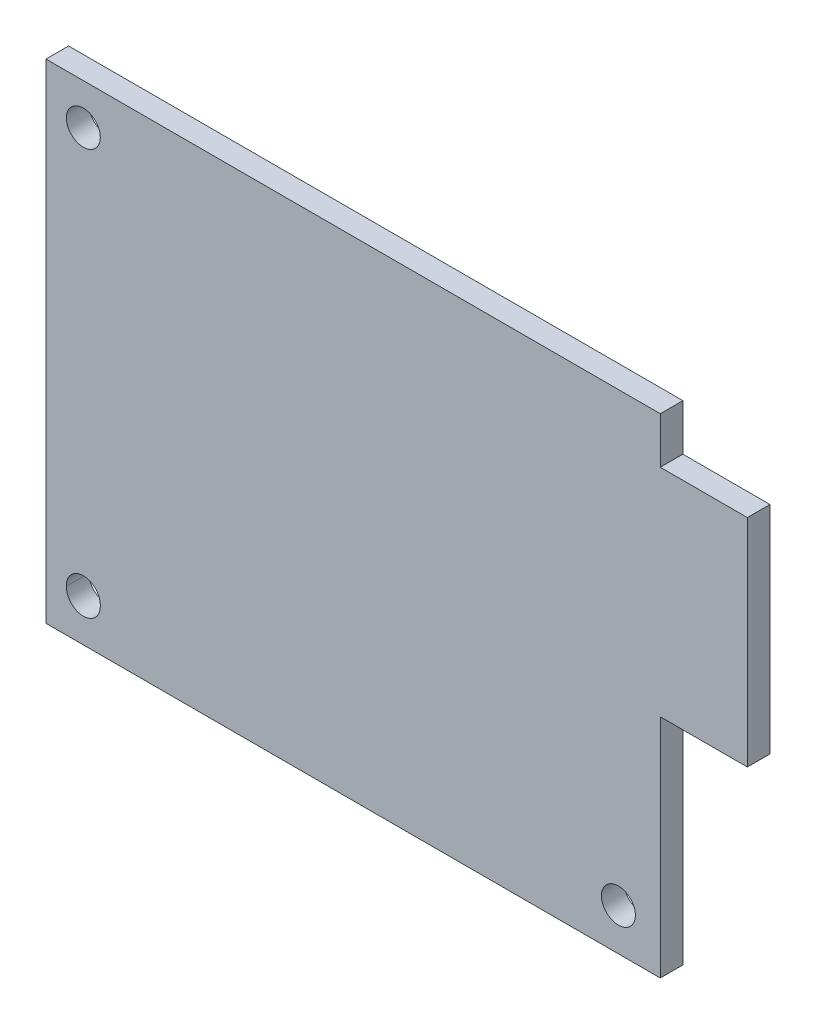
ISO-10303-21;
HEADER;
FILE_DESCRIPTION(('STEP AP214'),'2;1');
FILE_NAME('part.step','',(''),(''),'','','');
FILE_SCHEMA(('AUTOMOTIVE_DESIGN { 1 0 10303 214 1 1 1 1 }'));
ENDSEC;
DATA;
#1=APPLICATION_CONTEXT('core data for automotive mechanical design processes');
#2=APPLICATION_PROTOCOL_DEFINITION('international standard','automotive_design',2000,#1);
#3=PRODUCT_CONTEXT('',#1,'mechanical');
#4=PRODUCT('Part','Part','',(#3));
#5=PRODUCT_RELATED_PRODUCT_CATEGORY('part','',(#4));
#6=PRODUCT_DEFINITION_FORMATION('','',#4);
#7=PRODUCT_DEFINITION_CONTEXT('part definition',#1,'design');
#8=PRODUCT_DEFINITION('design','',#6,#7);
#9=PRODUCT_DEFINITION_SHAPE('','',#8);
#10=(LENGTH_UNIT() NAMED_UNIT(*) SI_UNIT(.MILLI.,.METRE.));
#11=(NAMED_UNIT(*) PLANE_ANGLE_UNIT() SI_UNIT($,.RADIAN.));
#12=(NAMED_UNIT(*) SI_UNIT($,.STERADIAN.) SOLID_ANGLE_UNIT());
#13=UNCERTAINTY_MEASURE_WITH_UNIT(LENGTH_MEASURE(1.E-05),#10,'distance_accuracy_value','');
#14=(GEOMETRIC_REPRESENTATION_CONTEXT(3) GLOBAL_UNCERTAINTY_ASSIGNED_CONTEXT((#13)) GLOBAL_UNIT_ASSIGNED_CONTEXT((#10,
#11,#12)) REPRESENTATION_CONTEXT('',''));
#15=CARTESIAN_POINT('',(0.,0.,0.));
#16=DIRECTION('',(0.,0.,1.));
#17=DIRECTION('',(1.,0.,0.));
#18=AXIS2_PLACEMENT_3D('',#15,#16,#17);
#19=CARTESIAN_POINT('',(27.15,-1.6,2.));
#20=DIRECTION('',(-1.,0.,0.));
#21=DIRECTION('',(0.,-1.,0.));
#22=AXIS2_PLACEMENT_3D('',#19,#20,#21);
#23=PLANE('',#22);
#24=DIRECTION('',(0.,1.,0.));
#25=VECTOR('',#24,1.);
#26=CARTESIAN_POINT('',(27.15,-1.6,0.));
#27=LINE('',#26,#25);
#28=CARTESIAN_POINT('',(27.15,-21.6,0.));
#29=VERTEX_POINT('',#28);
#30=CARTESIAN_POINT('',(27.15,-1.6,0.));
#31=VERTEX_POINT('',#30);
#32=EDGE_CURVE('E140',#29,#31,#27,.T.);
#33=ORIENTED_EDGE('',*,*,#32,.T.);
#34=DIRECTION('',(0.,0.,-1.));
#35=VECTOR('',#34,1.);
#36=CARTESIAN_POINT('',(27.15,-1.6,2.));
#37=LINE('',#36,#35);
#38=CARTESIAN_POINT('',(27.15,-1.6,2.));
#39=VERTEX_POINT('',#38);
#40=EDGE_CURVE('E40',#39,#31,#37,.T.);
#41=ORIENTED_EDGE('',*,*,#40,.F.);
#42=DIRECTION('',(0.,1.,0.));
#43=VECTOR('',#42,1.);
#44=CARTESIAN_POINT('',(27.15,-1.6,2.));
#45=LINE('',#44,#43);
#46=CARTESIAN_POINT('',(27.15,-21.6,2.));
#47=VERTEX_POINT('',#46);
#48=EDGE_CURVE('E156',#47,#39,#45,.T.);
#49=ORIENTED_EDGE('',*,*,#48,.F.);
#50=DIRECTION('',(0.,0.,-1.));
#51=VECTOR('',#50,1.);
#52=CARTESIAN_POINT('',(27.15,-21.6,2.));
#53=LINE('',#52,#51);
#54=EDGE_CURVE('E136',#47,#29,#53,.T.);
#55=ORIENTED_EDGE('',*,*,#54,.T.);
#56=EDGE_LOOP('',(#33,#41,#49,#55));
#57=FACE_BOUND('',#56,.T.);
#58=ADVANCED_FACE('F33',(#57),#23,.F.);
#59=CARTESIAN_POINT('',(34.85,-1.6,2.));
#60=DIRECTION('',(0.,1.,0.));
#61=DIRECTION('',(-1.,0.,0.));
#62=AXIS2_PLACEMENT_3D('',#59,#60,#61);
#63=PLANE('',#62);
#64=DIRECTION('',(1.,0.,0.));
#65=VECTOR('',#64,1.);
#66=CARTESIAN_POINT('',(34.85,-1.6,0.));
#67=LINE('',#66,#65);
#68=CARTESIAN_POINT('',(34.85,-1.6,0.));
#69=VERTEX_POINT('',#68);
#70=EDGE_CURVE('E143',#31,#69,#67,.T.);
#71=ORIENTED_EDGE('',*,*,#70,.T.);
#72=DIRECTION('',(0.,0.,-1.));
#73=VECTOR('',#72,1.);
#74=CARTESIAN_POINT('',(34.85,-1.6,2.));
#75=LINE('',#74,#73);
#76=CARTESIAN_POINT('',(34.85,-1.6,2.));
#77=VERTEX_POINT('',#76);
#78=EDGE_CURVE('E166',#77,#69,#75,.T.);
#79=ORIENTED_EDGE('',*,*,#78,.F.);
#80=DIRECTION('',(1.,0.,0.));
#81=VECTOR('',#80,1.);
#82=CARTESIAN_POINT('',(34.85,-1.6,2.));
#83=LINE('',#82,#81);
#84=EDGE_CURVE('E97',#39,#77,#83,.T.);
#85=ORIENTED_EDGE('',*,*,#84,.F.);
#86=ORIENTED_EDGE('',*,*,#40,.T.);
#87=EDGE_LOOP('',(#71,#79,#85,#86));
#88=FACE_BOUND('',#87,.T.);
#89=ADVANCED_FACE('F169',(#88),#63,.F.);
#90=CARTESIAN_POINT('',(34.85,17.5,2.));
#91=DIRECTION('',(-1.,0.,0.));
#92=DIRECTION('',(0.,-1.,0.));
#93=AXIS2_PLACEMENT_3D('',#90,#91,#92);
#94=PLANE('',#93);
#95=DIRECTION('',(0.,1.,0.));
#96=VECTOR('',#95,1.);
#97=CARTESIAN_POINT('',(34.85,17.5,0.));
#98=LINE('',#97,#96);
#99=CARTESIAN_POINT('',(34.85,17.5,0.));
#100=VERTEX_POINT('',#99);
#101=EDGE_CURVE('E146',#69,#100,#98,.T.);
#102=ORIENTED_EDGE('',*,*,#101,.T.);
#103=DIRECTION('',(0.,0.,-1.));
#104=VECTOR('',#103,1.);
#105=CARTESIAN_POINT('',(34.85,17.5,2.));
#106=LINE('',#105,#104);
#107=CARTESIAN_POINT('',(34.85,17.5,2.));
#108=VERTEX_POINT('',#107);
#109=EDGE_CURVE('E163',#108,#100,#106,.T.);
#110=ORIENTED_EDGE('',*,*,#109,.F.);
#111=DIRECTION('',(0.,1.,0.));
#112=VECTOR('',#111,1.);
#113=CARTESIAN_POINT('',(34.85,17.5,2.));
#114=LINE('',#113,#112);
#115=EDGE_CURVE('E187',#77,#108,#114,.T.);
#116=ORIENTED_EDGE('',*,*,#115,.F.);
#117=ORIENTED_EDGE('',*,*,#78,.T.);
#118=EDGE_LOOP('',(#102,#110,#116,#117));
#119=FACE_BOUND('',#118,.T.);
#120=ADVANCED_FACE('F180',(#119),#94,.F.);
#121=CARTESIAN_POINT('',(27.15,17.5,2.));
#122=DIRECTION('',(0.,-1.,0.));
#123=DIRECTION('',(0.,0.,-1.));
#124=AXIS2_PLACEMENT_3D('',#121,#122,#123);
#125=PLANE('',#124);
#126=DIRECTION('',(-1.,0.,0.));
#127=VECTOR('',#126,1.);
#128=CARTESIAN_POINT('',(27.15,17.5,0.));
#129=LINE('',#128,#127);
#130=CARTESIAN_POINT('',(27.15,17.5,0.));
#131=VERTEX_POINT('',#130);
#132=EDGE_CURVE('E148',#100,#131,#129,.T.);
#133=ORIENTED_EDGE('',*,*,#132,.T.);
#134=DIRECTION('',(0.,0.,-1.));
#135=VECTOR('',#134,1.);
#136=CARTESIAN_POINT('',(27.15,17.5,2.));
#137=LINE('',#136,#135);
#138=CARTESIAN_POINT('',(27.15,17.5,2.));
#139=VERTEX_POINT('',#138);
#140=EDGE_CURVE('E160',#139,#131,#137,.T.);
#141=ORIENTED_EDGE('',*,*,#140,.F.);
#142=DIRECTION('',(-1.,0.,0.));
#143=VECTOR('',#142,1.);
#144=CARTESIAN_POINT('',(27.15,17.5,2.));
#145=LINE('',#144,#143);
#146=EDGE_CURVE('E186',#108,#139,#145,.T.);
#147=ORIENTED_EDGE('',*,*,#146,.F.);
#148=ORIENTED_EDGE('',*,*,#109,.T.);
#149=EDGE_LOOP('',(#133,#141,#147,#148));
#150=FACE_BOUND('',#149,.T.);
#151=ADVANCED_FACE('F184',(#150),#125,.F.);
#152=CARTESIAN_POINT('',(27.15,21.6,2.));
#153=DIRECTION('',(-1.,0.,0.));
#154=DIRECTION('',(0.,0.,1.));
#155=AXIS2_PLACEMENT_3D('',#152,#153,#154);
#156=PLANE('',#155);
#157=DIRECTION('',(0.,1.,0.));
#158=VECTOR('',#157,1.);
#159=CARTESIAN_POINT('',(27.15,21.6,0.));
#160=LINE('',#159,#158);
#161=CARTESIAN_POINT('',(27.15,21.6,0.));
#162=VERTEX_POINT('',#161);
#163=EDGE_CURVE('E150',#131,#162,#160,.T.);
#164=ORIENTED_EDGE('',*,*,#163,.T.);
#165=DIRECTION('',(0.,0.,-1.));
#166=VECTOR('',#165,1.);
#167=CARTESIAN_POINT('',(27.15,21.6,2.));
#168=LINE('',#167,#166);
#169=CARTESIAN_POINT('',(27.15,21.6,2.));
#170=VERTEX_POINT('',#169);
#171=EDGE_CURVE('E131',#170,#162,#168,.T.);
#172=ORIENTED_EDGE('',*,*,#171,.F.);
#173=DIRECTION('',(0.,1.,0.));
#174=VECTOR('',#173,1.);
#175=CARTESIAN_POINT('',(27.15,21.6,2.));
#176=LINE('',#175,#174);
#177=EDGE_CURVE('E119',#139,#170,#176,.T.);
#178=ORIENTED_EDGE('',*,*,#177,.F.);
#179=ORIENTED_EDGE('',*,*,#140,.T.);
#180=EDGE_LOOP('',(#164,#172,#178,#179));
#181=FACE_BOUND('',#180,.T.);
#182=ADVANCED_FACE('F254',(#181),#156,.F.);
#183=CARTESIAN_POINT('',(-27.15,21.6,2.));
#184=DIRECTION('',(0.,-1.,0.));
#185=DIRECTION('',(0.,0.,-1.));
#186=AXIS2_PLACEMENT_3D('',#183,#184,#185);
#187=PLANE('',#186);
#188=DIRECTION('',(-1.,0.,0.));
#189=VECTOR('',#188,1.);
#190=CARTESIAN_POINT('',(-27.15,21.6,0.));
#191=LINE('',#190,#189);
#192=CARTESIAN_POINT('',(-27.15,21.6,0.));
#193=VERTEX_POINT('',#192);
#194=EDGE_CURVE('E128',#162,#193,#191,.T.);
#195=ORIENTED_EDGE('',*,*,#194,.T.);
#196=DIRECTION('',(0.,0.,-1.));
#197=VECTOR('',#196,1.);
#198=CARTESIAN_POINT('',(-27.15,21.6,2.));
#199=LINE('',#198,#197);
#200=CARTESIAN_POINT('',(-27.15,21.6,2.));
#201=VERTEX_POINT('',#200);
#202=EDGE_CURVE('E125',#201,#193,#199,.T.);
#203=ORIENTED_EDGE('',*,*,#202,.F.);
#204=DIRECTION('',(-1.,0.,0.));
#205=VECTOR('',#204,1.);
#206=CARTESIAN_POINT('',(-27.15,21.6,2.));
#207=LINE('',#206,#205);
#208=EDGE_CURVE('E112',#170,#201,#207,.T.);
#209=ORIENTED_EDGE('',*,*,#208,.F.);
#210=ORIENTED_EDGE('',*,*,#171,.T.);
#211=EDGE_LOOP('',(#195,#203,#209,#210));
#212=FACE_BOUND('',#211,.T.);
#213=ADVANCED_FACE('F126',(#212),#187,.F.);
#214=CARTESIAN_POINT('',(-27.15,21.6,2.));
#215=DIRECTION('',(1.,0.,0.));
#216=DIRECTION('',(0.,1.,0.));
#217=AXIS2_PLACEMENT_3D('',#214,#215,#216);
#218=PLANE('',#217);
#219=DIRECTION('',(0.,-1.,0.));
#220=VECTOR('',#219,1.);
#221=CARTESIAN_POINT('',(-27.15,21.6,0.));
#222=LINE('',#221,#220);
#223=CARTESIAN_POINT('',(-27.15,-21.6,0.));
#224=VERTEX_POINT('',#223);
#225=EDGE_CURVE('E153',#193,#224,#222,.T.);
#226=ORIENTED_EDGE('',*,*,#225,.T.);
#227=DIRECTION('',(0.,0.,-1.));
#228=VECTOR('',#227,1.);
#229=CARTESIAN_POINT('',(-27.15,-21.6,2.));
#230=LINE('',#229,#228);
#231=CARTESIAN_POINT('',(-27.15,-21.6,2.));
#232=VERTEX_POINT('',#231);
#233=EDGE_CURVE('E132',#232,#224,#230,.T.);
#234=ORIENTED_EDGE('',*,*,#233,.F.);
#235=DIRECTION('',(0.,-1.,0.));
#236=VECTOR('',#235,1.);
#237=CARTESIAN_POINT('',(-27.15,21.6,2.));
#238=LINE('',#237,#236);
#239=EDGE_CURVE('E116',#201,#232,#238,.T.);
#240=ORIENTED_EDGE('',*,*,#239,.F.);
#241=ORIENTED_EDGE('',*,*,#202,.T.);
#242=EDGE_LOOP('',(#226,#234,#240,#241));
#243=FACE_BOUND('',#242,.T.);
#244=ADVANCED_FACE('F134',(#243),#218,.F.);
#245=CARTESIAN_POINT('',(-27.15,-21.6,2.));
#246=DIRECTION('',(0.,1.,0.));
#247=DIRECTION('',(0.,0.,1.));
#248=AXIS2_PLACEMENT_3D('',#245,#246,#247);
#249=PLANE('',#248);
#250=DIRECTION('',(1.,0.,0.));
#251=VECTOR('',#250,1.);
#252=CARTESIAN_POINT('',(-27.15,-21.6,0.));
#253=LINE('',#252,#251);
#254=EDGE_CURVE('E88',#224,#29,#253,.T.);
#255=ORIENTED_EDGE('',*,*,#254,.T.);
#256=ORIENTED_EDGE('',*,*,#54,.F.);
#257=DIRECTION('',(1.,0.,0.));
#258=VECTOR('',#257,1.);
#259=CARTESIAN_POINT('',(-27.15,-21.6,2.));
#260=LINE('',#259,#258);
#261=EDGE_CURVE('E55',#232,#47,#260,.T.);
#262=ORIENTED_EDGE('',*,*,#261,.F.);
#263=ORIENTED_EDGE('',*,*,#233,.T.);
#264=EDGE_LOOP('',(#255,#256,#262,#263));
#265=FACE_BOUND('',#264,.T.);
#266=ADVANCED_FACE('F221',(#265),#249,.F.);
#267=CARTESIAN_POINT('',(0.,0.,2.));
#268=DIRECTION('',(0.,0.,1.));
#269=DIRECTION('',(1.,0.,0.));
#270=AXIS2_PLACEMENT_3D('',#267,#268,#269);
#271=PLANE('',#270);
#272=CARTESIAN_POINT('',(-23.85,18.,2.));
#273=DIRECTION('',(0.,0.,1.));
#274=DIRECTION('',(1.,0.,0.));
#275=AXIS2_PLACEMENT_3D('',#272,#273,#274);
#276=CIRCLE('',#275,1.5);
#277=CARTESIAN_POINT('',(-22.35,18.,2.));
#278=VERTEX_POINT('',#277);
#279=EDGE_CURVE('E213',#278,#278,#276,.T.);
#280=ORIENTED_EDGE('',*,*,#279,.F.);
#281=EDGE_LOOP('',(#280));
#282=FACE_BOUND('',#281,.T.);
#283=CARTESIAN_POINT('',(-23.85,-17.9,2.));
#284=DIRECTION('',(0.,0.,1.));
#285=DIRECTION('',(1.,0.,0.));
#286=AXIS2_PLACEMENT_3D('',#283,#284,#285);
#287=CIRCLE('',#286,1.5);
#288=CARTESIAN_POINT('',(-25.3491664350565,-17.85,2.));
#289=VERTEX_POINT('',#288);
#290=CARTESIAN_POINT('',(-22.3508335649435,-17.85,2.));
#291=VERTEX_POINT('',#290);
#292=EDGE_CURVE('E208',#289,#291,#287,.T.);
#293=ORIENTED_EDGE('',*,*,#292,.F.);
#294=CARTESIAN_POINT('',(-23.85,-17.8,2.));
#295=DIRECTION('',(0.,0.,1.));
#296=DIRECTION('',(1.,0.,0.));
#297=AXIS2_PLACEMENT_3D('',#294,#295,#296);
#298=CIRCLE('',#297,1.5);
#299=EDGE_CURVE('E201',#291,#289,#298,.T.);
#300=ORIENTED_EDGE('',*,*,#299,.F.);
#301=EDGE_LOOP('',(#293,#300));
#302=FACE_BOUND('',#301,.T.);
#303=CARTESIAN_POINT('',(23.45,-17.9,2.));
#304=DIRECTION('',(0.,0.,1.));
#305=DIRECTION('',(1.,0.,0.));
#306=AXIS2_PLACEMENT_3D('',#303,#304,#305);
#307=CIRCLE('',#306,1.5);
#308=CARTESIAN_POINT('',(24.95,-17.9,2.));
#309=VERTEX_POINT('',#308);
#310=EDGE_CURVE('E195',#309,#309,#307,.T.);
#311=ORIENTED_EDGE('',*,*,#310,.F.);
#312=EDGE_LOOP('',(#311));
#313=FACE_BOUND('',#312,.T.);
#314=ORIENTED_EDGE('',*,*,#48,.T.);
#315=ORIENTED_EDGE('',*,*,#84,.T.);
#316=ORIENTED_EDGE('',*,*,#115,.T.);
#317=ORIENTED_EDGE('',*,*,#146,.T.);
#318=ORIENTED_EDGE('',*,*,#177,.T.);
#319=ORIENTED_EDGE('',*,*,#208,.T.);
#320=ORIENTED_EDGE('',*,*,#239,.T.);
#321=ORIENTED_EDGE('',*,*,#261,.T.);
#322=EDGE_LOOP('',(#314,#315,#316,#317,#318,#319,#320,#321));
#323=FACE_BOUND('',#322,.T.);
#324=ADVANCED_FACE('F114',(#282,#302,#313,#323),#271,.T.);
#325=CARTESIAN_POINT('',(0.,0.,0.));
#326=DIRECTION('',(0.,0.,1.));
#327=DIRECTION('',(1.,0.,0.));
#328=AXIS2_PLACEMENT_3D('',#325,#326,#327);
#329=PLANE('',#328);
#330=CARTESIAN_POINT('',(-23.85,18.,0.));
#331=DIRECTION('',(0.,0.,1.));
#332=DIRECTION('',(1.,0.,0.));
#333=AXIS2_PLACEMENT_3D('',#330,#331,#332);
#334=CIRCLE('',#333,1.5);
#335=CARTESIAN_POINT('',(-22.35,18.,0.));
#336=VERTEX_POINT('',#335);
#337=EDGE_CURVE('E210',#336,#336,#334,.T.);
#338=ORIENTED_EDGE('',*,*,#337,.T.);
#339=EDGE_LOOP('',(#338));
#340=FACE_BOUND('',#339,.T.);
#341=CARTESIAN_POINT('',(-23.85,-17.8,0.));
#342=DIRECTION('',(0.,0.,1.));
#343=DIRECTION('',(1.,0.,0.));
#344=AXIS2_PLACEMENT_3D('',#341,#342,#343);
#345=CIRCLE('',#344,1.5);
#346=CARTESIAN_POINT('',(-22.3508335649435,-17.85,0.));
#347=VERTEX_POINT('',#346);
#348=CARTESIAN_POINT('',(-25.3491664350565,-17.85,0.));
#349=VERTEX_POINT('',#348);
#350=EDGE_CURVE('E198',#347,#349,#345,.T.);
#351=ORIENTED_EDGE('',*,*,#350,.T.);
#352=CARTESIAN_POINT('',(-23.85,-17.9,0.));
#353=DIRECTION('',(0.,0.,1.));
#354=DIRECTION('',(1.,0.,0.));
#355=AXIS2_PLACEMENT_3D('',#352,#353,#354);
#356=CIRCLE('',#355,1.5);
#357=EDGE_CURVE('E11',#349,#347,#356,.T.);
#358=ORIENTED_EDGE('',*,*,#357,.T.);
#359=EDGE_LOOP('',(#351,#358));
#360=FACE_BOUND('',#359,.T.);
#361=CARTESIAN_POINT('',(23.45,-17.9,0.));
#362=DIRECTION('',(0.,0.,1.));
#363=DIRECTION('',(1.,0.,0.));
#364=AXIS2_PLACEMENT_3D('',#361,#362,#363);
#365=CIRCLE('',#364,1.5);
#366=CARTESIAN_POINT('',(24.95,-17.9,0.));
#367=VERTEX_POINT('',#366);
#368=EDGE_CURVE('E144',#367,#367,#365,.T.);
#369=ORIENTED_EDGE('',*,*,#368,.T.);
#370=EDGE_LOOP('',(#369));
#371=FACE_BOUND('',#370,.T.);
#372=ORIENTED_EDGE('',*,*,#32,.F.);
#373=ORIENTED_EDGE('',*,*,#254,.F.);
#374=ORIENTED_EDGE('',*,*,#225,.F.);
#375=ORIENTED_EDGE('',*,*,#194,.F.);
#376=ORIENTED_EDGE('',*,*,#163,.F.);
#377=ORIENTED_EDGE('',*,*,#132,.F.);
#378=ORIENTED_EDGE('',*,*,#101,.F.);
#379=ORIENTED_EDGE('',*,*,#70,.F.);
#380=EDGE_LOOP('',(#372,#373,#374,#375,#376,#377,#378,#379));
#381=FACE_BOUND('',#380,.T.);
#382=ADVANCED_FACE('F174',(#340,#360,#371,#381),#329,.F.);
#383=CARTESIAN_POINT('',(23.45,-17.9,2.));
#384=DIRECTION('',(0.,0.,1.));
#385=DIRECTION('',(1.,0.,0.));
#386=AXIS2_PLACEMENT_3D('',#383,#384,#385);
#387=CYLINDRICAL_SURFACE('',#386,1.5);
#388=ORIENTED_EDGE('',*,*,#368,.F.);
#389=EDGE_LOOP('',(#388));
#390=FACE_BOUND('',#389,.T.);
#391=ORIENTED_EDGE('',*,*,#310,.T.);
#392=EDGE_LOOP('',(#391));
#393=FACE_BOUND('',#392,.T.);
#394=ADVANCED_FACE('F228',(#390,#393),#387,.F.);
#395=CARTESIAN_POINT('',(-23.85,-17.8,2.));
#396=DIRECTION('',(0.,0.,1.));
#397=DIRECTION('',(1.,0.,0.));
#398=AXIS2_PLACEMENT_3D('',#395,#396,#397);
#399=CYLINDRICAL_SURFACE('',#398,1.5);
#400=ORIENTED_EDGE('',*,*,#350,.F.);
#401=DIRECTION('',(0.,0.,1.));
#402=VECTOR('',#401,1.);
#403=CARTESIAN_POINT('',(-22.3508335649435,-17.85,1.));
#404=LINE('',#403,#402);
#405=EDGE_CURVE('E47',#347,#291,#404,.T.);
#406=ORIENTED_EDGE('',*,*,#405,.T.);
#407=ORIENTED_EDGE('',*,*,#299,.T.);
#408=DIRECTION('',(0.,0.,1.));
#409=VECTOR('',#408,1.);
#410=CARTESIAN_POINT('',(-25.3491664350565,-17.85,1.));
#411=LINE('',#410,#409);
#412=EDGE_CURVE('E205',#289,#349,#411,.F.);
#413=ORIENTED_EDGE('',*,*,#412,.T.);
#414=EDGE_LOOP('',(#400,#406,#407,#413));
#415=FACE_BOUND('',#414,.T.);
#416=ADVANCED_FACE('F230',(#415),#399,.F.);
#417=CARTESIAN_POINT('',(-23.85,-17.9,2.));
#418=DIRECTION('',(0.,0.,1.));
#419=DIRECTION('',(1.,0.,0.));
#420=AXIS2_PLACEMENT_3D('',#417,#418,#419);
#421=CYLINDRICAL_SURFACE('',#420,1.5);
#422=ORIENTED_EDGE('',*,*,#357,.F.);
#423=ORIENTED_EDGE('',*,*,#412,.F.);
#424=ORIENTED_EDGE('',*,*,#292,.T.);
#425=ORIENTED_EDGE('',*,*,#405,.F.);
#426=EDGE_LOOP('',(#422,#423,#424,#425));
#427=FACE_BOUND('',#426,.T.);
#428=ADVANCED_FACE('F237',(#427),#421,.F.);
#429=CARTESIAN_POINT('',(-23.85,18.,2.));
#430=DIRECTION('',(0.,0.,1.));
#431=DIRECTION('',(1.,0.,0.));
#432=AXIS2_PLACEMENT_3D('',#429,#430,#431);
#433=CYLINDRICAL_SURFACE('',#432,1.5);
#434=ORIENTED_EDGE('',*,*,#337,.F.);
#435=EDGE_LOOP('',(#434));
#436=FACE_BOUND('',#435,.T.);
#437=ORIENTED_EDGE('',*,*,#279,.T.);
#438=EDGE_LOOP('',(#437));
#439=FACE_BOUND('',#438,.T.);
#440=ADVANCED_FACE('F217',(#436,#439),#433,.F.);
#441=CLOSED_SHELL('',(#58,#89,#120,#151,#182,#213,#244,#266,#324,#382,#394,#416,#428,#440));
#442=MANIFOLD_SOLID_BREP('B2',#441);
#443=ADVANCED_BREP_SHAPE_REPRESENTATION('',(#18,#442),#14);
#444=SHAPE_DEFINITION_REPRESENTATION(#9,#443);
ENDSEC;
END-ISO-10303-21;
